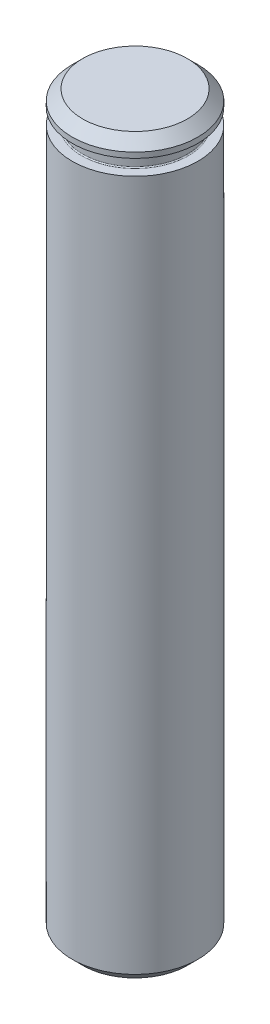
ISO-10303-21;
HEADER;
FILE_DESCRIPTION(('STEP AP214'),'2;1');
FILE_NAME('part.step','',(''),(''),'','','');
FILE_SCHEMA(('AUTOMOTIVE_DESIGN { 1 0 10303 214 1 1 1 1 }'));
ENDSEC;
DATA;
#1=APPLICATION_CONTEXT('core data for automotive mechanical design processes');
#2=APPLICATION_PROTOCOL_DEFINITION('international standard','automotive_design',2000,#1);
#3=PRODUCT_CONTEXT('',#1,'mechanical');
#4=PRODUCT('Part','Part','',(#3));
#5=PRODUCT_RELATED_PRODUCT_CATEGORY('part','',(#4));
#6=PRODUCT_DEFINITION_FORMATION('','',#4);
#7=PRODUCT_DEFINITION_CONTEXT('part definition',#1,'design');
#8=PRODUCT_DEFINITION('design','',#6,#7);
#9=PRODUCT_DEFINITION_SHAPE('','',#8);
#10=(LENGTH_UNIT() NAMED_UNIT(*) SI_UNIT(.MILLI.,.METRE.));
#11=(NAMED_UNIT(*) PLANE_ANGLE_UNIT() SI_UNIT($,.RADIAN.));
#12=(NAMED_UNIT(*) SI_UNIT($,.STERADIAN.) SOLID_ANGLE_UNIT());
#13=UNCERTAINTY_MEASURE_WITH_UNIT(LENGTH_MEASURE(1.E-05),#10,'distance_accuracy_value','');
#14=(GEOMETRIC_REPRESENTATION_CONTEXT(3) GLOBAL_UNCERTAINTY_ASSIGNED_CONTEXT((#13)) GLOBAL_UNIT_ASSIGNED_CONTEXT((#10,
#11,#12)) REPRESENTATION_CONTEXT('',''));
#15=CARTESIAN_POINT('',(0.,0.,0.));
#16=DIRECTION('',(0.,0.,1.));
#17=DIRECTION('',(1.,0.,0.));
#18=AXIS2_PLACEMENT_3D('',#15,#16,#17);
#19=CARTESIAN_POINT('',(0.,0.,0.));
#20=DIRECTION('',(0.,-1.,0.));
#21=DIRECTION('',(0.,0.,-1.));
#22=AXIS2_PLACEMENT_3D('',#19,#20,#21);
#23=CYLINDRICAL_SURFACE('',#22,3.);
#24=CARTESIAN_POINT('',(0.,34.5,0.));
#25=DIRECTION('',(0.,1.,0.));
#26=DIRECTION('',(0.,0.,1.));
#27=AXIS2_PLACEMENT_3D('',#24,#25,#26);
#28=CIRCLE('',#27,3.);
#29=CARTESIAN_POINT('',(0.,34.5,3.));
#30=VERTEX_POINT('',#29);
#31=EDGE_CURVE('E37',#30,#30,#28,.F.);
#32=ORIENTED_EDGE('',*,*,#31,.T.);
#33=EDGE_LOOP('',(#32));
#34=FACE_BOUND('',#33,.T.);
#35=CARTESIAN_POINT('',(0.,34.24,0.));
#36=DIRECTION('',(0.,-1.,0.));
#37=DIRECTION('',(0.,0.,-1.));
#38=AXIS2_PLACEMENT_3D('',#35,#36,#37);
#39=CIRCLE('',#38,3.);
#40=CARTESIAN_POINT('',(0.,34.24,-3.));
#41=VERTEX_POINT('',#40);
#42=EDGE_CURVE('E50',#41,#41,#39,.F.);
#43=ORIENTED_EDGE('',*,*,#42,.T.);
#44=EDGE_LOOP('',(#43));
#45=FACE_BOUND('',#44,.T.);
#46=ADVANCED_FACE('F30',(#34,#45),#23,.T.);
#47=CARTESIAN_POINT('',(0.,35.,0.));
#48=DIRECTION('',(0.,1.,0.));
#49=DIRECTION('',(0.,0.,1.));
#50=AXIS2_PLACEMENT_3D('',#47,#48,#49);
#51=PLANE('',#50);
#52=CARTESIAN_POINT('',(0.,35.,0.));
#53=DIRECTION('',(0.,1.,0.));
#54=DIRECTION('',(0.,0.,1.));
#55=AXIS2_PLACEMENT_3D('',#52,#53,#54);
#56=CIRCLE('',#55,2.49999999999999);
#57=CARTESIAN_POINT('',(0.,35.,2.49999999999999));
#58=VERTEX_POINT('',#57);
#59=EDGE_CURVE('E10',#58,#58,#56,.T.);
#60=ORIENTED_EDGE('',*,*,#59,.T.);
#61=EDGE_LOOP('',(#60));
#62=FACE_BOUND('',#61,.T.);
#63=ADVANCED_FACE('F87',(#62),#51,.T.);
#64=CARTESIAN_POINT('',(0.,34.24,-2.54999999999999));
#65=DIRECTION('',(0.,-1.,0.));
#66=DIRECTION('',(0.,0.,-1.));
#67=AXIS2_PLACEMENT_3D('',#64,#65,#66);
#68=PLANE('',#67);
#69=ORIENTED_EDGE('',*,*,#42,.F.);
#70=EDGE_LOOP('',(#69));
#71=FACE_BOUND('',#70,.T.);
#72=CARTESIAN_POINT('',(0.,34.24,0.));
#73=DIRECTION('',(0.,-1.,0.));
#74=DIRECTION('',(0.,0.,-1.));
#75=AXIS2_PLACEMENT_3D('',#72,#73,#74);
#76=CIRCLE('',#75,2.54999999999999);
#77=CARTESIAN_POINT('',(0.,34.24,-2.54999999999999));
#78=VERTEX_POINT('',#77);
#79=EDGE_CURVE('E56',#78,#78,#76,.T.);
#80=ORIENTED_EDGE('',*,*,#79,.F.);
#81=EDGE_LOOP('',(#80));
#82=FACE_BOUND('',#81,.T.);
#83=ADVANCED_FACE('F93',(#71,#82),#68,.T.);
#84=CARTESIAN_POINT('',(0.,34.19,0.));
#85=DIRECTION('',(0.,-1.,0.));
#86=DIRECTION('',(0.,0.,-1.));
#87=AXIS2_PLACEMENT_3D('',#84,#85,#86);
#88=TOROIDAL_SURFACE('',#87,2.54999999999999,0.050000000000001);
#89=ORIENTED_EDGE('',*,*,#79,.T.);
#90=EDGE_LOOP('',(#89));
#91=FACE_BOUND('',#90,.T.);
#92=CARTESIAN_POINT('',(0.,34.19,0.));
#93=DIRECTION('',(0.,-1.,0.));
#94=DIRECTION('',(0.,0.,-1.));
#95=AXIS2_PLACEMENT_3D('',#92,#93,#94);
#96=CIRCLE('',#95,2.49999999999999);
#97=CARTESIAN_POINT('',(0.,34.19,-2.49999999999999));
#98=VERTEX_POINT('',#97);
#99=EDGE_CURVE('E59',#98,#98,#96,.T.);
#100=ORIENTED_EDGE('',*,*,#99,.F.);
#101=EDGE_LOOP('',(#100));
#102=FACE_BOUND('',#101,.T.);
#103=ADVANCED_FACE('F83',(#91,#102),#88,.F.);
#104=CARTESIAN_POINT('',(0.,50.,0.));
#105=DIRECTION('',(0.,-1.,0.));
#106=DIRECTION('',(0.,0.,-1.));
#107=AXIS2_PLACEMENT_3D('',#104,#105,#106);
#108=CYLINDRICAL_SURFACE('',#107,2.49999999999999);
#109=ORIENTED_EDGE('',*,*,#99,.T.);
#110=EDGE_LOOP('',(#109));
#111=FACE_BOUND('',#110,.T.);
#112=CARTESIAN_POINT('',(0.,33.55,0.));
#113=DIRECTION('',(0.,-1.,0.));
#114=DIRECTION('',(0.,0.,-1.));
#115=AXIS2_PLACEMENT_3D('',#112,#113,#114);
#116=CIRCLE('',#115,2.49999999999999);
#117=CARTESIAN_POINT('',(0.,33.55,-2.49999999999999));
#118=VERTEX_POINT('',#117);
#119=EDGE_CURVE('E62',#118,#118,#116,.T.);
#120=ORIENTED_EDGE('',*,*,#119,.F.);
#121=EDGE_LOOP('',(#120));
#122=FACE_BOUND('',#121,.T.);
#123=ADVANCED_FACE('F73',(#111,#122),#108,.T.);
#124=CARTESIAN_POINT('',(0.,33.55,0.));
#125=DIRECTION('',(0.,-1.,0.));
#126=DIRECTION('',(0.,0.,-1.));
#127=AXIS2_PLACEMENT_3D('',#124,#125,#126);
#128=TOROIDAL_SURFACE('',#127,2.54999999999999,0.0500000000000008);
#129=ORIENTED_EDGE('',*,*,#119,.T.);
#130=EDGE_LOOP('',(#129));
#131=FACE_BOUND('',#130,.T.);
#132=CARTESIAN_POINT('',(0.,33.5,0.));
#133=DIRECTION('',(0.,-1.,0.));
#134=DIRECTION('',(0.,0.,-1.));
#135=AXIS2_PLACEMENT_3D('',#132,#133,#134);
#136=CIRCLE('',#135,2.54999999999999);
#137=CARTESIAN_POINT('',(0.,33.5,-2.54999999999999));
#138=VERTEX_POINT('',#137);
#139=EDGE_CURVE('E65',#138,#138,#136,.T.);
#140=ORIENTED_EDGE('',*,*,#139,.F.);
#141=EDGE_LOOP('',(#140));
#142=FACE_BOUND('',#141,.T.);
#143=ADVANCED_FACE('F71',(#131,#142),#128,.F.);
#144=CARTESIAN_POINT('',(0.,33.5,-3.6));
#145=DIRECTION('',(0.,1.,0.));
#146=DIRECTION('',(0.,0.,1.));
#147=AXIS2_PLACEMENT_3D('',#144,#145,#146);
#148=PLANE('',#147);
#149=CARTESIAN_POINT('',(0.,33.5,0.));
#150=DIRECTION('',(0.,1.,0.));
#151=DIRECTION('',(0.,0.,1.));
#152=AXIS2_PLACEMENT_3D('',#149,#150,#151);
#153=CIRCLE('',#152,3.);
#154=CARTESIAN_POINT('',(0.,33.5,3.));
#155=VERTEX_POINT('',#154);
#156=EDGE_CURVE('E53',#155,#155,#153,.F.);
#157=ORIENTED_EDGE('',*,*,#156,.F.);
#158=EDGE_LOOP('',(#157));
#159=FACE_BOUND('',#158,.T.);
#160=ORIENTED_EDGE('',*,*,#139,.T.);
#161=EDGE_LOOP('',(#160));
#162=FACE_BOUND('',#161,.T.);
#163=ADVANCED_FACE('F69',(#159,#162),#148,.T.);
#164=CARTESIAN_POINT('',(0.,0.,0.));
#165=DIRECTION('',(0.,-1.,0.));
#166=DIRECTION('',(0.,0.,-1.));
#167=AXIS2_PLACEMENT_3D('',#164,#165,#166);
#168=PLANE('',#167);
#169=CARTESIAN_POINT('',(0.,0.,0.));
#170=DIRECTION('',(0.,-1.,0.));
#171=DIRECTION('',(0.,0.,-1.));
#172=AXIS2_PLACEMENT_3D('',#169,#170,#171);
#173=CIRCLE('',#172,2.49999999999999);
#174=CARTESIAN_POINT('',(0.,0.,-2.49999999999999));
#175=VERTEX_POINT('',#174);
#176=EDGE_CURVE('E45',#175,#175,#173,.T.);
#177=ORIENTED_EDGE('',*,*,#176,.T.);
#178=EDGE_LOOP('',(#177));
#179=FACE_BOUND('',#178,.T.);
#180=ADVANCED_FACE('F80',(#179),#168,.T.);
#181=CARTESIAN_POINT('',(0.,0.500000000000005,0.));
#182=DIRECTION('',(0.,-1.,0.));
#183=DIRECTION('',(0.,0.,-1.));
#184=AXIS2_PLACEMENT_3D('',#181,#182,#183);
#185=CIRCLE('',#184,3.);
#186=CARTESIAN_POINT('',(0.,0.500000000000005,-3.));
#187=VERTEX_POINT('',#186);
#188=EDGE_CURVE('E41',#187,#187,#185,.F.);
#189=ORIENTED_EDGE('',*,*,#188,.T.);
#190=EDGE_LOOP('',(#189));
#191=FACE_BOUND('',#190,.T.);
#192=ORIENTED_EDGE('',*,*,#156,.T.);
#193=EDGE_LOOP('',(#192));
#194=FACE_BOUND('',#193,.T.);
#195=ADVANCED_FACE('F89',(#191,#194),#23,.T.);
#196=CARTESIAN_POINT('',(0.,0.,0.));
#197=DIRECTION('',(0.,1.,0.));
#198=DIRECTION('',(0.,0.,1.));
#199=AXIS2_PLACEMENT_3D('',#196,#197,#198);
#200=CONICAL_SURFACE('',#199,2.49999999999999,0.785398163397448);
#201=ORIENTED_EDGE('',*,*,#188,.F.);
#202=EDGE_LOOP('',(#201));
#203=FACE_BOUND('',#202,.T.);
#204=ORIENTED_EDGE('',*,*,#176,.F.);
#205=EDGE_LOOP('',(#204));
#206=FACE_BOUND('',#205,.T.);
#207=ADVANCED_FACE('F98',(#203,#206),#200,.T.);
#208=CARTESIAN_POINT('',(0.,34.5,0.));
#209=DIRECTION('',(0.,-1.,0.));
#210=DIRECTION('',(0.,0.,-1.));
#211=AXIS2_PLACEMENT_3D('',#208,#209,#210);
#212=CONICAL_SURFACE('',#211,3.,0.785398163397446);
#213=ORIENTED_EDGE('',*,*,#59,.F.);
#214=EDGE_LOOP('',(#213));
#215=FACE_BOUND('',#214,.T.);
#216=ORIENTED_EDGE('',*,*,#31,.F.);
#217=EDGE_LOOP('',(#216));
#218=FACE_BOUND('',#217,.T.);
#219=ADVANCED_FACE('F32',(#215,#218),#212,.T.);
#220=CLOSED_SHELL('',(#46,#63,#83,#103,#123,#143,#163,#180,#195,#207,#219));
#221=MANIFOLD_SOLID_BREP('B2',#220);
#222=ADVANCED_BREP_SHAPE_REPRESENTATION('',(#18,#221),#14);
#223=SHAPE_DEFINITION_REPRESENTATION(#9,#222);
ENDSEC;
END-ISO-10303-21;
